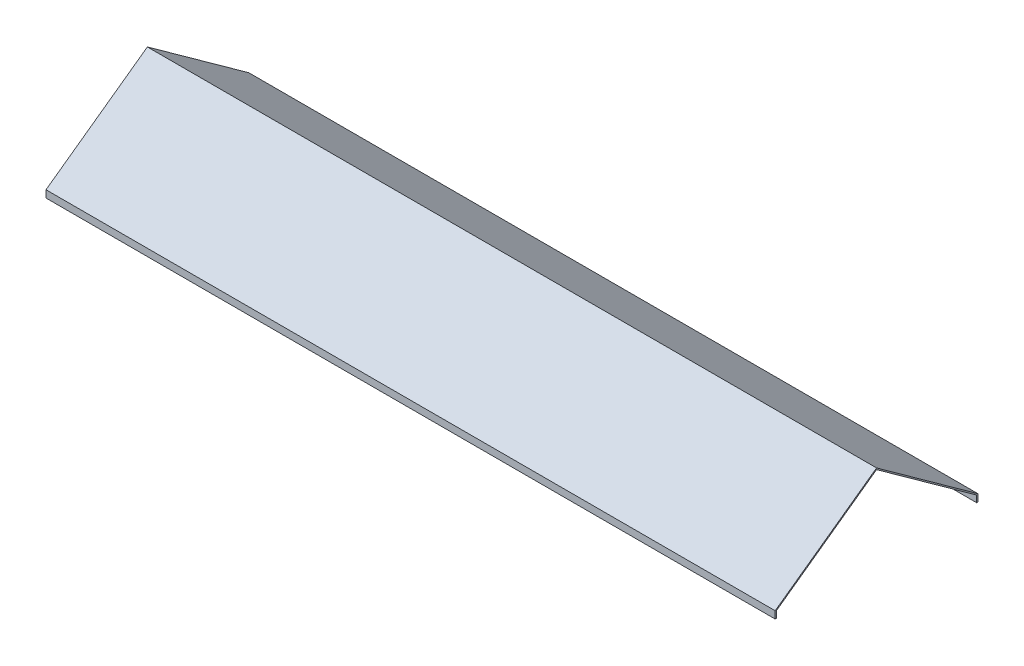
ISO-10303-21;
HEADER;
FILE_DESCRIPTION(('STEP AP214'),'2;1');
FILE_NAME('part.step','',(''),(''),'','','');
FILE_SCHEMA(('AUTOMOTIVE_DESIGN { 1 0 10303 214 1 1 1 1 }'));
ENDSEC;
DATA;
#1=APPLICATION_CONTEXT('core data for automotive mechanical design processes');
#2=APPLICATION_PROTOCOL_DEFINITION('international standard','automotive_design',2000,#1);
#3=PRODUCT_CONTEXT('',#1,'mechanical');
#4=PRODUCT('Part','Part','',(#3));
#5=PRODUCT_RELATED_PRODUCT_CATEGORY('part','',(#4));
#6=PRODUCT_DEFINITION_FORMATION('','',#4);
#7=PRODUCT_DEFINITION_CONTEXT('part definition',#1,'design');
#8=PRODUCT_DEFINITION('design','',#6,#7);
#9=PRODUCT_DEFINITION_SHAPE('','',#8);
#10=(LENGTH_UNIT() NAMED_UNIT(*) SI_UNIT(.MILLI.,.METRE.));
#11=(NAMED_UNIT(*) PLANE_ANGLE_UNIT() SI_UNIT($,.RADIAN.));
#12=(NAMED_UNIT(*) SI_UNIT($,.STERADIAN.) SOLID_ANGLE_UNIT());
#13=UNCERTAINTY_MEASURE_WITH_UNIT(LENGTH_MEASURE(1.E-05),#10,'distance_accuracy_value','');
#14=(GEOMETRIC_REPRESENTATION_CONTEXT(3) GLOBAL_UNCERTAINTY_ASSIGNED_CONTEXT((#13)) GLOBAL_UNIT_ASSIGNED_CONTEXT((#10,
#11,#12)) REPRESENTATION_CONTEXT('',''));
#15=CARTESIAN_POINT('',(0.,0.,0.));
#16=DIRECTION('',(0.,0.,1.));
#17=DIRECTION('',(1.,0.,0.));
#18=AXIS2_PLACEMENT_3D('',#15,#16,#17);
#19=CARTESIAN_POINT('',(910.,90.,0.));
#20=DIRECTION('',(0.,0.811534341451494,-0.584304725845076));
#21=DIRECTION('',(0.,0.584304725845076,0.811534341451495));
#22=AXIS2_PLACEMENT_3D('',#19,#20,#21);
#23=PLANE('',#22);
#24=DIRECTION('',(0.,-0.584304725845076,-0.811534341451494));
#25=VECTOR('',#24,1.);
#26=CARTESIAN_POINT('',(0.,90.,0.));
#27=LINE('',#26,#25);
#28=CARTESIAN_POINT('',(0.,90.,0.));
#29=VERTEX_POINT('',#28);
#30=CARTESIAN_POINT('',(0.,0.,-125.));
#31=VERTEX_POINT('',#30);
#32=EDGE_CURVE('E154',#29,#31,#27,.T.);
#33=ORIENTED_EDGE('',*,*,#32,.T.);
#34=DIRECTION('',(-1.,0.,0.));
#35=VECTOR('',#34,1.);
#36=CARTESIAN_POINT('',(910.,0.,-125.));
#37=LINE('',#36,#35);
#38=CARTESIAN_POINT('',(910.,0.,-125.));
#39=VERTEX_POINT('',#38);
#40=EDGE_CURVE('E11',#39,#31,#37,.T.);
#41=ORIENTED_EDGE('',*,*,#40,.F.);
#42=DIRECTION('',(0.,-0.584304725845076,-0.811534341451494));
#43=VECTOR('',#42,1.);
#44=CARTESIAN_POINT('',(910.,90.,0.));
#45=LINE('',#44,#43);
#46=CARTESIAN_POINT('',(910.,90.,0.));
#47=VERTEX_POINT('',#46);
#48=EDGE_CURVE('E182',#47,#39,#45,.T.);
#49=ORIENTED_EDGE('',*,*,#48,.F.);
#50=DIRECTION('',(-1.,0.,0.));
#51=VECTOR('',#50,1.);
#52=CARTESIAN_POINT('',(910.,90.,0.));
#53=LINE('',#52,#51);
#54=EDGE_CURVE('E150',#47,#29,#53,.T.);
#55=ORIENTED_EDGE('',*,*,#54,.T.);
#56=EDGE_LOOP('',(#33,#41,#49,#55));
#57=FACE_BOUND('',#56,.T.);
#58=ADVANCED_FACE('F41',(#57),#23,.F.);
#59=CARTESIAN_POINT('',(910.,-8.30330604938303,-125.));
#60=DIRECTION('',(0.,0.,-1.));
#61=DIRECTION('',(-1.,0.,0.));
#62=AXIS2_PLACEMENT_3D('',#59,#60,#61);
#63=PLANE('',#62);
#64=DIRECTION('',(0.,-1.,0.));
#65=VECTOR('',#64,1.);
#66=CARTESIAN_POINT('',(0.,-8.30330604938303,-125.));
#67=LINE('',#66,#65);
#68=CARTESIAN_POINT('',(0.,-8.30330604938303,-125.));
#69=VERTEX_POINT('',#68);
#70=EDGE_CURVE('E158',#31,#69,#67,.T.);
#71=ORIENTED_EDGE('',*,*,#70,.T.);
#72=DIRECTION('',(-1.,0.,0.));
#73=VECTOR('',#72,1.);
#74=CARTESIAN_POINT('',(910.,-8.30330604938303,-125.));
#75=LINE('',#74,#73);
#76=CARTESIAN_POINT('',(910.,-8.30330604938303,-125.));
#77=VERTEX_POINT('',#76);
#78=EDGE_CURVE('E50',#77,#69,#75,.T.);
#79=ORIENTED_EDGE('',*,*,#78,.F.);
#80=DIRECTION('',(0.,-1.,0.));
#81=VECTOR('',#80,1.);
#82=CARTESIAN_POINT('',(910.,-8.30330604938303,-125.));
#83=LINE('',#82,#81);
#84=EDGE_CURVE('E107',#39,#77,#83,.T.);
#85=ORIENTED_EDGE('',*,*,#84,.F.);
#86=ORIENTED_EDGE('',*,*,#40,.T.);
#87=EDGE_LOOP('',(#71,#79,#85,#86));
#88=FACE_BOUND('',#87,.T.);
#89=ADVANCED_FACE('F246',(#88),#63,.F.);
#90=CARTESIAN_POINT('',(910.,-8.30330604938303,-126.59952314649));
#91=DIRECTION('',(0.,1.,0.));
#92=DIRECTION('',(0.,0.,1.));
#93=AXIS2_PLACEMENT_3D('',#90,#91,#92);
#94=PLANE('',#93);
#95=DIRECTION('',(0.,0.,-1.));
#96=VECTOR('',#95,1.);
#97=CARTESIAN_POINT('',(0.,-8.30330604938303,-126.59952314649));
#98=LINE('',#97,#96);
#99=CARTESIAN_POINT('',(0.,-8.30330604938303,-126.59952314649));
#100=VERTEX_POINT('',#99);
#101=EDGE_CURVE('E161',#69,#100,#98,.T.);
#102=ORIENTED_EDGE('',*,*,#101,.T.);
#103=DIRECTION('',(-1.,0.,0.));
#104=VECTOR('',#103,1.);
#105=CARTESIAN_POINT('',(910.,-8.30330604938303,-126.59952314649));
#106=LINE('',#105,#104);
#107=CARTESIAN_POINT('',(910.,-8.30330604938303,-126.59952314649));
#108=VERTEX_POINT('',#107);
#109=EDGE_CURVE('E201',#108,#100,#106,.T.);
#110=ORIENTED_EDGE('',*,*,#109,.F.);
#111=DIRECTION('',(0.,0.,-1.));
#112=VECTOR('',#111,1.);
#113=CARTESIAN_POINT('',(910.,-8.30330604938303,-126.59952314649));
#114=LINE('',#113,#112);
#115=EDGE_CURVE('E211',#77,#108,#114,.T.);
#116=ORIENTED_EDGE('',*,*,#115,.F.);
#117=ORIENTED_EDGE('',*,*,#78,.T.);
#118=EDGE_LOOP('',(#102,#110,#116,#117));
#119=FACE_BOUND('',#118,.T.);
#120=ADVANCED_FACE('F209',(#119),#94,.F.);
#121=CARTESIAN_POINT('',(910.,0.696693950616967,-126.59952314649));
#122=DIRECTION('',(0.,0.,1.));
#123=DIRECTION('',(1.,0.,0.));
#124=AXIS2_PLACEMENT_3D('',#121,#122,#123);
#125=PLANE('',#124);
#126=DIRECTION('',(0.,1.,0.));
#127=VECTOR('',#126,1.);
#128=CARTESIAN_POINT('',(0.,0.696693950616967,-126.59952314649));
#129=LINE('',#128,#127);
#130=CARTESIAN_POINT('',(0.,0.696693950616967,-126.59952314649));
#131=VERTEX_POINT('',#130);
#132=EDGE_CURVE('E164',#100,#131,#129,.T.);
#133=ORIENTED_EDGE('',*,*,#132,.T.);
#134=DIRECTION('',(-1.,0.,0.));
#135=VECTOR('',#134,1.);
#136=CARTESIAN_POINT('',(910.,0.696693950616967,-126.59952314649));
#137=LINE('',#136,#135);
#138=CARTESIAN_POINT('',(910.,0.696693950616967,-126.59952314649));
#139=VERTEX_POINT('',#138);
#140=EDGE_CURVE('E197',#139,#131,#137,.T.);
#141=ORIENTED_EDGE('',*,*,#140,.F.);
#142=DIRECTION('',(0.,1.,0.));
#143=VECTOR('',#142,1.);
#144=CARTESIAN_POINT('',(910.,0.696693950616967,-126.59952314649));
#145=LINE('',#144,#143);
#146=EDGE_CURVE('E230',#108,#139,#145,.T.);
#147=ORIENTED_EDGE('',*,*,#146,.F.);
#148=ORIENTED_EDGE('',*,*,#109,.T.);
#149=EDGE_LOOP('',(#133,#141,#147,#148));
#150=FACE_BOUND('',#149,.T.);
#151=ADVANCED_FACE('F220',(#150),#125,.F.);
#152=CARTESIAN_POINT('',(910.,91.8483506160899,0.));
#153=DIRECTION('',(0.,-0.811534341451494,0.584304725845076));
#154=DIRECTION('',(0.,-0.584304725845076,-0.811534341451495));
#155=AXIS2_PLACEMENT_3D('',#152,#153,#154);
#156=PLANE('',#155);
#157=DIRECTION('',(0.,0.584304725845076,0.811534341451494));
#158=VECTOR('',#157,1.);
#159=CARTESIAN_POINT('',(0.,91.8483506160899,0.));
#160=LINE('',#159,#158);
#161=CARTESIAN_POINT('',(0.,91.8483506160899,0.));
#162=VERTEX_POINT('',#161);
#163=EDGE_CURVE('E167',#131,#162,#160,.T.);
#164=ORIENTED_EDGE('',*,*,#163,.T.);
#165=DIRECTION('',(-1.,0.,0.));
#166=VECTOR('',#165,1.);
#167=CARTESIAN_POINT('',(910.,91.8483506160899,0.));
#168=LINE('',#167,#166);
#169=CARTESIAN_POINT('',(910.,91.8483506160899,0.));
#170=VERTEX_POINT('',#169);
#171=EDGE_CURVE('E193',#170,#162,#168,.T.);
#172=ORIENTED_EDGE('',*,*,#171,.F.);
#173=DIRECTION('',(0.,0.584304725845076,0.811534341451494));
#174=VECTOR('',#173,1.);
#175=CARTESIAN_POINT('',(910.,91.8483506160899,0.));
#176=LINE('',#175,#174);
#177=EDGE_CURVE('E226',#139,#170,#176,.T.);
#178=ORIENTED_EDGE('',*,*,#177,.F.);
#179=ORIENTED_EDGE('',*,*,#140,.T.);
#180=EDGE_LOOP('',(#164,#172,#178,#179));
#181=FACE_BOUND('',#180,.T.);
#182=ADVANCED_FACE('F224',(#181),#156,.F.);
#183=CARTESIAN_POINT('',(910.,0.768350616089886,126.5));
#184=DIRECTION('',(0.,-0.811534341451494,-0.584304725845076));
#185=DIRECTION('',(0.,0.584304725845076,-0.811534341451494));
#186=AXIS2_PLACEMENT_3D('',#183,#184,#185);
#187=PLANE('',#186);
#188=DIRECTION('',(0.,-0.584304725845076,0.811534341451495));
#189=VECTOR('',#188,1.);
#190=CARTESIAN_POINT('',(0.,0.768350616089886,126.5));
#191=LINE('',#190,#189);
#192=CARTESIAN_POINT('',(0.,0.768350616089886,126.5));
#193=VERTEX_POINT('',#192);
#194=EDGE_CURVE('E170',#162,#193,#191,.T.);
#195=ORIENTED_EDGE('',*,*,#194,.T.);
#196=DIRECTION('',(-1.,0.,0.));
#197=VECTOR('',#196,1.);
#198=CARTESIAN_POINT('',(910.,0.768350616089886,126.5));
#199=LINE('',#198,#197);
#200=CARTESIAN_POINT('',(910.,0.768350616089886,126.5));
#201=VERTEX_POINT('',#200);
#202=EDGE_CURVE('E189',#201,#193,#199,.T.);
#203=ORIENTED_EDGE('',*,*,#202,.F.);
#204=DIRECTION('',(0.,-0.584304725845076,0.811534341451495));
#205=VECTOR('',#204,1.);
#206=CARTESIAN_POINT('',(910.,0.768350616089886,126.5));
#207=LINE('',#206,#205);
#208=EDGE_CURVE('E229',#170,#201,#207,.T.);
#209=ORIENTED_EDGE('',*,*,#208,.F.);
#210=ORIENTED_EDGE('',*,*,#171,.T.);
#211=EDGE_LOOP('',(#195,#203,#209,#210));
#212=FACE_BOUND('',#211,.T.);
#213=ADVANCED_FACE('F258',(#212),#187,.F.);
#214=CARTESIAN_POINT('',(910.,-8.23164938391011,126.5));
#215=DIRECTION('',(0.,0.,-1.));
#216=DIRECTION('',(-1.,0.,0.));
#217=AXIS2_PLACEMENT_3D('',#214,#215,#216);
#218=PLANE('',#217);
#219=DIRECTION('',(0.,-1.,0.));
#220=VECTOR('',#219,1.);
#221=CARTESIAN_POINT('',(0.,-8.23164938391011,126.5));
#222=LINE('',#221,#220);
#223=CARTESIAN_POINT('',(0.,-8.23164938391011,126.5));
#224=VERTEX_POINT('',#223);
#225=EDGE_CURVE('E173',#193,#224,#222,.T.);
#226=ORIENTED_EDGE('',*,*,#225,.T.);
#227=DIRECTION('',(-1.,0.,0.));
#228=VECTOR('',#227,1.);
#229=CARTESIAN_POINT('',(910.,-8.23164938391011,126.5));
#230=LINE('',#229,#228);
#231=CARTESIAN_POINT('',(910.,-8.23164938391011,126.5));
#232=VERTEX_POINT('',#231);
#233=EDGE_CURVE('E143',#232,#224,#230,.T.);
#234=ORIENTED_EDGE('',*,*,#233,.F.);
#235=DIRECTION('',(0.,-1.,0.));
#236=VECTOR('',#235,1.);
#237=CARTESIAN_POINT('',(910.,-8.23164938391011,126.5));
#238=LINE('',#237,#236);
#239=EDGE_CURVE('E132',#201,#232,#238,.T.);
#240=ORIENTED_EDGE('',*,*,#239,.F.);
#241=ORIENTED_EDGE('',*,*,#202,.T.);
#242=EDGE_LOOP('',(#226,#234,#240,#241));
#243=FACE_BOUND('',#242,.T.);
#244=ADVANCED_FACE('F261',(#243),#218,.F.);
#245=CARTESIAN_POINT('',(910.,-8.23164938391011,125.));
#246=DIRECTION('',(0.,1.,0.));
#247=DIRECTION('',(0.,0.,1.));
#248=AXIS2_PLACEMENT_3D('',#245,#246,#247);
#249=PLANE('',#248);
#250=DIRECTION('',(0.,0.,-1.));
#251=VECTOR('',#250,1.);
#252=CARTESIAN_POINT('',(0.,-8.23164938391011,125.));
#253=LINE('',#252,#251);
#254=CARTESIAN_POINT('',(0.,-8.23164938391011,125.));
#255=VERTEX_POINT('',#254);
#256=EDGE_CURVE('E141',#224,#255,#253,.T.);
#257=ORIENTED_EDGE('',*,*,#256,.T.);
#258=DIRECTION('',(-1.,0.,0.));
#259=VECTOR('',#258,1.);
#260=CARTESIAN_POINT('',(910.,-8.23164938391011,125.));
#261=LINE('',#260,#259);
#262=CARTESIAN_POINT('',(910.,-8.23164938391011,125.));
#263=VERTEX_POINT('',#262);
#264=EDGE_CURVE('E138',#263,#255,#261,.T.);
#265=ORIENTED_EDGE('',*,*,#264,.F.);
#266=DIRECTION('',(0.,0.,-1.));
#267=VECTOR('',#266,1.);
#268=CARTESIAN_POINT('',(910.,-8.23164938391011,125.));
#269=LINE('',#268,#267);
#270=EDGE_CURVE('E126',#232,#263,#269,.T.);
#271=ORIENTED_EDGE('',*,*,#270,.F.);
#272=ORIENTED_EDGE('',*,*,#233,.T.);
#273=EDGE_LOOP('',(#257,#265,#271,#272));
#274=FACE_BOUND('',#273,.T.);
#275=ADVANCED_FACE('F139',(#274),#249,.F.);
#276=CARTESIAN_POINT('',(910.,0.,125.));
#277=DIRECTION('',(0.,0.,1.));
#278=DIRECTION('',(1.,0.,0.));
#279=AXIS2_PLACEMENT_3D('',#276,#277,#278);
#280=PLANE('',#279);
#281=DIRECTION('',(0.,1.,0.));
#282=VECTOR('',#281,1.);
#283=CARTESIAN_POINT('',(0.,0.,125.));
#284=LINE('',#283,#282);
#285=CARTESIAN_POINT('',(0.,0.,125.));
#286=VERTEX_POINT('',#285);
#287=EDGE_CURVE('E93',#255,#286,#284,.T.);
#288=ORIENTED_EDGE('',*,*,#287,.T.);
#289=DIRECTION('',(-1.,0.,0.));
#290=VECTOR('',#289,1.);
#291=CARTESIAN_POINT('',(910.,0.,125.));
#292=LINE('',#291,#290);
#293=CARTESIAN_POINT('',(910.,0.,125.));
#294=VERTEX_POINT('',#293);
#295=EDGE_CURVE('E144',#294,#286,#292,.T.);
#296=ORIENTED_EDGE('',*,*,#295,.F.);
#297=DIRECTION('',(0.,1.,0.));
#298=VECTOR('',#297,1.);
#299=CARTESIAN_POINT('',(910.,0.,125.));
#300=LINE('',#299,#298);
#301=EDGE_CURVE('E130',#263,#294,#300,.T.);
#302=ORIENTED_EDGE('',*,*,#301,.F.);
#303=ORIENTED_EDGE('',*,*,#264,.T.);
#304=EDGE_LOOP('',(#288,#296,#302,#303));
#305=FACE_BOUND('',#304,.T.);
#306=ADVANCED_FACE('F146',(#305),#280,.F.);
#307=CARTESIAN_POINT('',(910.,0.,125.));
#308=DIRECTION('',(0.,0.811534341451494,0.584304725845076));
#309=DIRECTION('',(0.,-0.584304725845076,0.811534341451495));
#310=AXIS2_PLACEMENT_3D('',#307,#308,#309);
#311=PLANE('',#310);
#312=DIRECTION('',(0.,0.584304725845076,-0.811534341451494));
#313=VECTOR('',#312,1.);
#314=CARTESIAN_POINT('',(0.,0.,125.));
#315=LINE('',#314,#313);
#316=EDGE_CURVE('E99',#286,#29,#315,.T.);
#317=ORIENTED_EDGE('',*,*,#316,.T.);
#318=ORIENTED_EDGE('',*,*,#54,.F.);
#319=DIRECTION('',(0.,0.584304725845076,-0.811534341451494));
#320=VECTOR('',#319,1.);
#321=CARTESIAN_POINT('',(910.,0.,125.));
#322=LINE('',#321,#320);
#323=EDGE_CURVE('E58',#294,#47,#322,.T.);
#324=ORIENTED_EDGE('',*,*,#323,.F.);
#325=ORIENTED_EDGE('',*,*,#295,.T.);
#326=EDGE_LOOP('',(#317,#318,#324,#325));
#327=FACE_BOUND('',#326,.T.);
#328=ADVANCED_FACE('F270',(#327),#311,.F.);
#329=CARTESIAN_POINT('',(910.,0.,0.));
#330=DIRECTION('',(1.,0.,0.));
#331=DIRECTION('',(0.,0.,-1.));
#332=AXIS2_PLACEMENT_3D('',#329,#330,#331);
#333=PLANE('',#332);
#334=ORIENTED_EDGE('',*,*,#48,.T.);
#335=ORIENTED_EDGE('',*,*,#84,.T.);
#336=ORIENTED_EDGE('',*,*,#115,.T.);
#337=ORIENTED_EDGE('',*,*,#146,.T.);
#338=ORIENTED_EDGE('',*,*,#177,.T.);
#339=ORIENTED_EDGE('',*,*,#208,.T.);
#340=ORIENTED_EDGE('',*,*,#239,.T.);
#341=ORIENTED_EDGE('',*,*,#270,.T.);
#342=ORIENTED_EDGE('',*,*,#301,.T.);
#343=ORIENTED_EDGE('',*,*,#323,.T.);
#344=EDGE_LOOP('',(#334,#335,#336,#337,#338,#339,#340,#341,#342,#343));
#345=FACE_BOUND('',#344,.T.);
#346=ADVANCED_FACE('F128',(#345),#333,.T.);
#347=CARTESIAN_POINT('',(0.,0.,0.));
#348=DIRECTION('',(1.,0.,0.));
#349=DIRECTION('',(0.,0.,-1.));
#350=AXIS2_PLACEMENT_3D('',#347,#348,#349);
#351=PLANE('',#350);
#352=ORIENTED_EDGE('',*,*,#32,.F.);
#353=ORIENTED_EDGE('',*,*,#316,.F.);
#354=ORIENTED_EDGE('',*,*,#287,.F.);
#355=ORIENTED_EDGE('',*,*,#256,.F.);
#356=ORIENTED_EDGE('',*,*,#225,.F.);
#357=ORIENTED_EDGE('',*,*,#194,.F.);
#358=ORIENTED_EDGE('',*,*,#163,.F.);
#359=ORIENTED_EDGE('',*,*,#132,.F.);
#360=ORIENTED_EDGE('',*,*,#101,.F.);
#361=ORIENTED_EDGE('',*,*,#70,.F.);
#362=EDGE_LOOP('',(#352,#353,#354,#355,#356,#357,#358,#359,#360,#361));
#363=FACE_BOUND('',#362,.T.);
#364=ADVANCED_FACE('F215',(#363),#351,.F.);
#365=CLOSED_SHELL('',(#58,#89,#120,#151,#182,#213,#244,#275,#306,#328,#346,#364));
#366=MANIFOLD_SOLID_BREP('B2',#365);
#367=ADVANCED_BREP_SHAPE_REPRESENTATION('',(#18,#366),#14);
#368=SHAPE_DEFINITION_REPRESENTATION(#9,#367);
ENDSEC;
END-ISO-10303-21;
